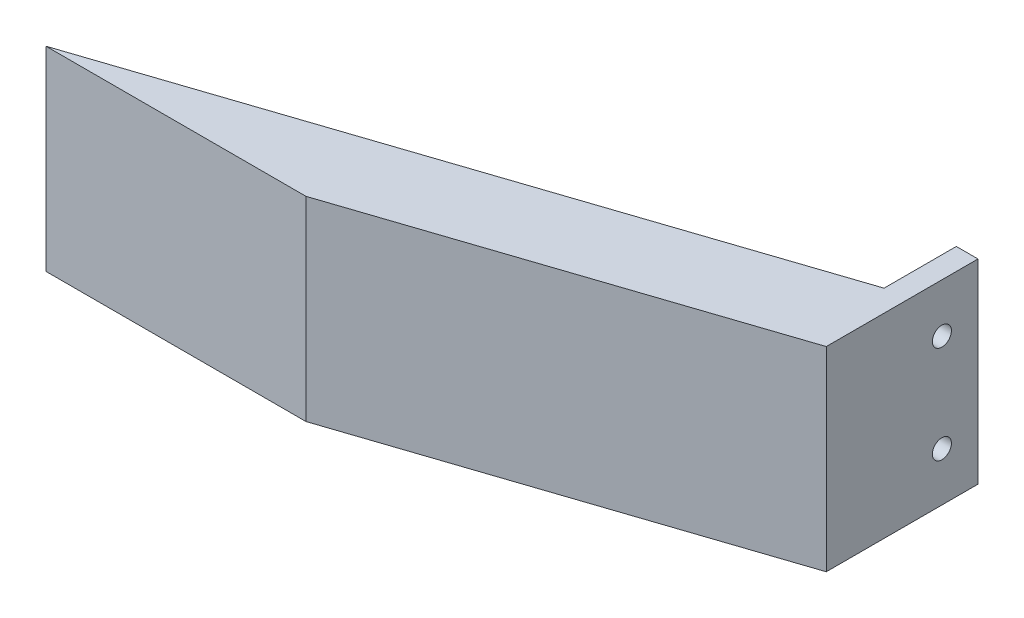
ISO-10303-21;
HEADER;
FILE_DESCRIPTION(('STEP AP214'),'2;1');
FILE_NAME('part.step','',(''),(''),'','','');
FILE_SCHEMA(('AUTOMOTIVE_DESIGN { 1 0 10303 214 1 1 1 1 }'));
ENDSEC;
DATA;
#1=APPLICATION_CONTEXT('core data for automotive mechanical design processes');
#2=APPLICATION_PROTOCOL_DEFINITION('international standard','automotive_design',2000,#1);
#3=PRODUCT_CONTEXT('',#1,'mechanical');
#4=PRODUCT('Part','Part','',(#3));
#5=PRODUCT_RELATED_PRODUCT_CATEGORY('part','',(#4));
#6=PRODUCT_DEFINITION_FORMATION('','',#4);
#7=PRODUCT_DEFINITION_CONTEXT('part definition',#1,'design');
#8=PRODUCT_DEFINITION('design','',#6,#7);
#9=PRODUCT_DEFINITION_SHAPE('','',#8);
#10=(LENGTH_UNIT() NAMED_UNIT(*) SI_UNIT(.MILLI.,.METRE.));
#11=(NAMED_UNIT(*) PLANE_ANGLE_UNIT() SI_UNIT($,.RADIAN.));
#12=(NAMED_UNIT(*) SI_UNIT($,.STERADIAN.) SOLID_ANGLE_UNIT());
#13=UNCERTAINTY_MEASURE_WITH_UNIT(LENGTH_MEASURE(1.E-05),#10,'distance_accuracy_value','');
#14=(GEOMETRIC_REPRESENTATION_CONTEXT(3) GLOBAL_UNCERTAINTY_ASSIGNED_CONTEXT((#13)) GLOBAL_UNIT_ASSIGNED_CONTEXT((#10,
#11,#12)) REPRESENTATION_CONTEXT('',''));
#15=CARTESIAN_POINT('',(0.,0.,0.));
#16=DIRECTION('',(0.,0.,1.));
#17=DIRECTION('',(1.,0.,0.));
#18=AXIS2_PLACEMENT_3D('',#15,#16,#17);
#19=CARTESIAN_POINT('',(0.,45.,0.));
#20=DIRECTION('',(-0.316227766016838,0.,-0.948683298050514));
#21=DIRECTION('',(-0.948683298050514,0.,0.316227766016838));
#22=AXIS2_PLACEMENT_3D('',#19,#20,#21);
#23=PLANE('',#22);
#24=DIRECTION('',(0.948683298050514,0.,-0.316227766016838));
#25=VECTOR('',#24,1.);
#26=CARTESIAN_POINT('',(0.,45.,0.));
#27=LINE('',#26,#25);
#28=CARTESIAN_POINT('',(0.,45.,0.));
#29=VERTEX_POINT('',#28);
#30=CARTESIAN_POINT('',(145.,45.,-48.3333333333333));
#31=VERTEX_POINT('',#30);
#32=EDGE_CURVE('E61',#29,#31,#27,.T.);
#33=ORIENTED_EDGE('',*,*,#32,.T.);
#34=DIRECTION('',(0.,-1.,0.));
#35=VECTOR('',#34,1.);
#36=CARTESIAN_POINT('',(145.,45.,-48.3333333333333));
#37=LINE('',#36,#35);
#38=CARTESIAN_POINT('',(145.,0.,-48.3333333333333));
#39=VERTEX_POINT('',#38);
#40=EDGE_CURVE('E65',#31,#39,#37,.T.);
#41=ORIENTED_EDGE('',*,*,#40,.T.);
#42=DIRECTION('',(0.948683298050514,0.,-0.316227766016838));
#43=VECTOR('',#42,1.);
#44=CARTESIAN_POINT('',(0.,0.,0.));
#45=LINE('',#44,#43);
#46=CARTESIAN_POINT('',(0.,0.,0.));
#47=VERTEX_POINT('',#46);
#48=EDGE_CURVE('E104',#47,#39,#45,.T.);
#49=ORIENTED_EDGE('',*,*,#48,.F.);
#50=DIRECTION('',(0.,-1.,0.));
#51=VECTOR('',#50,1.);
#52=CARTESIAN_POINT('',(0.,45.,0.));
#53=LINE('',#52,#51);
#54=EDGE_CURVE('E54',#29,#47,#53,.T.);
#55=ORIENTED_EDGE('',*,*,#54,.F.);
#56=EDGE_LOOP('',(#33,#41,#49,#55));
#57=FACE_BOUND('',#56,.T.);
#58=ADVANCED_FACE('F45',(#57),#23,.T.);
#59=CARTESIAN_POINT('',(5.99430039478565,45.,17.9880799986134));
#60=DIRECTION('',(0.31614582397381,0.,0.948710608132913));
#61=DIRECTION('',(0.948710608132913,0.,-0.31614582397381));
#62=AXIS2_PLACEMENT_3D('',#59,#60,#61);
#63=PLANE('',#62);
#64=DIRECTION('',(-0.948710608132913,0.,0.31614582397381));
#65=VECTOR('',#64,1.);
#66=CARTESIAN_POINT('',(5.99430039478565,0.,17.9880799986134));
#67=LINE('',#66,#65);
#68=CARTESIAN_POINT('',(150.,0.,-30.));
#69=VERTEX_POINT('',#68);
#70=CARTESIAN_POINT('',(59.9740813076652,0.,0.));
#71=VERTEX_POINT('',#70);
#72=EDGE_CURVE('E136',#69,#71,#67,.T.);
#73=ORIENTED_EDGE('',*,*,#72,.F.);
#74=DIRECTION('',(0.,-1.,0.));
#75=VECTOR('',#74,1.);
#76=CARTESIAN_POINT('',(150.,45.,-30.));
#77=LINE('',#76,#75);
#78=CARTESIAN_POINT('',(150.,45.,-30.));
#79=VERTEX_POINT('',#78);
#80=EDGE_CURVE('E11',#79,#69,#77,.T.);
#81=ORIENTED_EDGE('',*,*,#80,.F.);
#82=DIRECTION('',(-0.948710608132913,0.,0.31614582397381));
#83=VECTOR('',#82,1.);
#84=CARTESIAN_POINT('',(5.99430039478565,45.,17.9880799986134));
#85=LINE('',#84,#83);
#86=CARTESIAN_POINT('',(59.9740813076652,45.,0.));
#87=VERTEX_POINT('',#86);
#88=EDGE_CURVE('E137',#79,#87,#85,.T.);
#89=ORIENTED_EDGE('',*,*,#88,.T.);
#90=DIRECTION('',(0.,-1.,0.));
#91=VECTOR('',#90,1.);
#92=CARTESIAN_POINT('',(59.9740813076652,45.,0.));
#93=LINE('',#92,#91);
#94=EDGE_CURVE('E150',#87,#71,#93,.T.);
#95=ORIENTED_EDGE('',*,*,#94,.T.);
#96=EDGE_LOOP('',(#73,#81,#89,#95));
#97=FACE_BOUND('',#96,.T.);
#98=ADVANCED_FACE('F47',(#97),#63,.T.);
#99=CARTESIAN_POINT('',(150.,45.,0.));
#100=DIRECTION('',(-1.,0.,0.));
#101=DIRECTION('',(0.,0.,1.));
#102=AXIS2_PLACEMENT_3D('',#99,#100,#101);
#103=PLANE('',#102);
#104=CARTESIAN_POINT('',(150.,11.25,-56.6666666666667));
#105=DIRECTION('',(-1.,0.,0.));
#106=DIRECTION('',(0.,0.,1.));
#107=AXIS2_PLACEMENT_3D('',#104,#105,#106);
#108=CIRCLE('',#107,2.2);
#109=CARTESIAN_POINT('',(150.,11.25,-54.4666666666667));
#110=VERTEX_POINT('',#109);
#111=EDGE_CURVE('E131',#110,#110,#108,.T.);
#112=ORIENTED_EDGE('',*,*,#111,.T.);
#113=EDGE_LOOP('',(#112));
#114=FACE_BOUND('',#113,.T.);
#115=CARTESIAN_POINT('',(150.,33.75,-56.6666666666667));
#116=DIRECTION('',(-1.,0.,0.));
#117=DIRECTION('',(0.,0.,1.));
#118=AXIS2_PLACEMENT_3D('',#115,#116,#117);
#119=CIRCLE('',#118,2.2);
#120=CARTESIAN_POINT('',(150.,33.75,-54.4666666666667));
#121=VERTEX_POINT('',#120);
#122=EDGE_CURVE('E190',#121,#121,#119,.T.);
#123=ORIENTED_EDGE('',*,*,#122,.T.);
#124=EDGE_LOOP('',(#123));
#125=FACE_BOUND('',#124,.T.);
#126=DIRECTION('',(0.,0.,-1.));
#127=VECTOR('',#126,1.);
#128=CARTESIAN_POINT('',(150.,0.,0.));
#129=LINE('',#128,#127);
#130=CARTESIAN_POINT('',(150.,0.,-65.));
#131=VERTEX_POINT('',#130);
#132=EDGE_CURVE('E154',#69,#131,#129,.T.);
#133=ORIENTED_EDGE('',*,*,#132,.T.);
#134=DIRECTION('',(0.,1.,0.));
#135=VECTOR('',#134,1.);
#136=CARTESIAN_POINT('',(150.,45.,-65.));
#137=LINE('',#136,#135);
#138=CARTESIAN_POINT('',(150.,45.,-65.));
#139=VERTEX_POINT('',#138);
#140=EDGE_CURVE('E109',#131,#139,#137,.T.);
#141=ORIENTED_EDGE('',*,*,#140,.T.);
#142=DIRECTION('',(0.,0.,-1.));
#143=VECTOR('',#142,1.);
#144=CARTESIAN_POINT('',(150.,45.,0.));
#145=LINE('',#144,#143);
#146=EDGE_CURVE('E141',#79,#139,#145,.T.);
#147=ORIENTED_EDGE('',*,*,#146,.F.);
#148=ORIENTED_EDGE('',*,*,#80,.T.);
#149=EDGE_LOOP('',(#133,#141,#147,#148));
#150=FACE_BOUND('',#149,.T.);
#151=ADVANCED_FACE('F174',(#114,#125,#150),#103,.F.);
#152=CARTESIAN_POINT('',(0.,45.,0.));
#153=DIRECTION('',(0.,0.,-1.));
#154=DIRECTION('',(-1.,0.,0.));
#155=AXIS2_PLACEMENT_3D('',#152,#153,#154);
#156=PLANE('',#155);
#157=DIRECTION('',(1.,0.,0.));
#158=VECTOR('',#157,1.);
#159=CARTESIAN_POINT('',(0.,0.,0.));
#160=LINE('',#159,#158);
#161=EDGE_CURVE('E142',#47,#71,#160,.T.);
#162=ORIENTED_EDGE('',*,*,#161,.T.);
#163=ORIENTED_EDGE('',*,*,#94,.F.);
#164=DIRECTION('',(1.,0.,0.));
#165=VECTOR('',#164,1.);
#166=CARTESIAN_POINT('',(0.,45.,0.));
#167=LINE('',#166,#165);
#168=EDGE_CURVE('E147',#29,#87,#167,.T.);
#169=ORIENTED_EDGE('',*,*,#168,.F.);
#170=ORIENTED_EDGE('',*,*,#54,.T.);
#171=EDGE_LOOP('',(#162,#163,#169,#170));
#172=FACE_BOUND('',#171,.T.);
#173=ADVANCED_FACE('F166',(#172),#156,.F.);
#174=CARTESIAN_POINT('',(0.,45.,0.));
#175=DIRECTION('',(0.,1.,0.));
#176=DIRECTION('',(0.,0.,1.));
#177=AXIS2_PLACEMENT_3D('',#174,#175,#176);
#178=PLANE('',#177);
#179=ORIENTED_EDGE('',*,*,#88,.F.);
#180=ORIENTED_EDGE('',*,*,#146,.T.);
#181=DIRECTION('',(1.,0.,0.));
#182=VECTOR('',#181,1.);
#183=CARTESIAN_POINT('',(145.,45.,-65.));
#184=LINE('',#183,#182);
#185=CARTESIAN_POINT('',(145.,45.,-65.));
#186=VERTEX_POINT('',#185);
#187=EDGE_CURVE('E118',#186,#139,#184,.T.);
#188=ORIENTED_EDGE('',*,*,#187,.F.);
#189=DIRECTION('',(0.,0.,1.));
#190=VECTOR('',#189,1.);
#191=CARTESIAN_POINT('',(145.,45.,-30.));
#192=LINE('',#191,#190);
#193=EDGE_CURVE('E119',#186,#31,#192,.T.);
#194=ORIENTED_EDGE('',*,*,#193,.T.);
#195=ORIENTED_EDGE('',*,*,#32,.F.);
#196=ORIENTED_EDGE('',*,*,#168,.T.);
#197=EDGE_LOOP('',(#179,#180,#188,#194,#195,#196));
#198=FACE_BOUND('',#197,.T.);
#199=ADVANCED_FACE('F183',(#198),#178,.T.);
#200=CARTESIAN_POINT('',(0.,0.,0.));
#201=DIRECTION('',(0.,1.,0.));
#202=DIRECTION('',(0.,0.,1.));
#203=AXIS2_PLACEMENT_3D('',#200,#201,#202);
#204=PLANE('',#203);
#205=ORIENTED_EDGE('',*,*,#132,.F.);
#206=ORIENTED_EDGE('',*,*,#72,.T.);
#207=ORIENTED_EDGE('',*,*,#161,.F.);
#208=ORIENTED_EDGE('',*,*,#48,.T.);
#209=DIRECTION('',(0.,0.,-1.));
#210=VECTOR('',#209,1.);
#211=CARTESIAN_POINT('',(145.,0.,-30.));
#212=LINE('',#211,#210);
#213=CARTESIAN_POINT('',(145.,0.,-65.));
#214=VERTEX_POINT('',#213);
#215=EDGE_CURVE('E97',#39,#214,#212,.T.);
#216=ORIENTED_EDGE('',*,*,#215,.T.);
#217=DIRECTION('',(1.,0.,0.));
#218=VECTOR('',#217,1.);
#219=CARTESIAN_POINT('',(145.,0.,-65.));
#220=LINE('',#219,#218);
#221=EDGE_CURVE('E101',#214,#131,#220,.T.);
#222=ORIENTED_EDGE('',*,*,#221,.T.);
#223=EDGE_LOOP('',(#205,#206,#207,#208,#216,#222));
#224=FACE_BOUND('',#223,.T.);
#225=ADVANCED_FACE('F100',(#224),#204,.F.);
#226=CARTESIAN_POINT('',(145.,45.,-65.));
#227=DIRECTION('',(0.,0.,-1.));
#228=DIRECTION('',(-1.,0.,0.));
#229=AXIS2_PLACEMENT_3D('',#226,#227,#228);
#230=PLANE('',#229);
#231=ORIENTED_EDGE('',*,*,#140,.F.);
#232=ORIENTED_EDGE('',*,*,#221,.F.);
#233=DIRECTION('',(0.,1.,0.));
#234=VECTOR('',#233,1.);
#235=CARTESIAN_POINT('',(145.,45.,-65.));
#236=LINE('',#235,#234);
#237=EDGE_CURVE('E108',#214,#186,#236,.T.);
#238=ORIENTED_EDGE('',*,*,#237,.T.);
#239=ORIENTED_EDGE('',*,*,#187,.T.);
#240=EDGE_LOOP('',(#231,#232,#238,#239));
#241=FACE_BOUND('',#240,.T.);
#242=ADVANCED_FACE('F113',(#241),#230,.T.);
#243=CARTESIAN_POINT('',(145.,0.,0.));
#244=DIRECTION('',(1.,0.,0.));
#245=DIRECTION('',(0.,0.,-1.));
#246=AXIS2_PLACEMENT_3D('',#243,#244,#245);
#247=PLANE('',#246);
#248=CARTESIAN_POINT('',(145.,11.25,-56.6666666666667));
#249=DIRECTION('',(-1.,0.,0.));
#250=DIRECTION('',(0.,0.,1.));
#251=AXIS2_PLACEMENT_3D('',#248,#249,#250);
#252=CIRCLE('',#251,2.2);
#253=CARTESIAN_POINT('',(145.,11.25,-54.4666666666667));
#254=VERTEX_POINT('',#253);
#255=EDGE_CURVE('E217',#254,#254,#252,.T.);
#256=ORIENTED_EDGE('',*,*,#255,.F.);
#257=EDGE_LOOP('',(#256));
#258=FACE_BOUND('',#257,.T.);
#259=CARTESIAN_POINT('',(145.,33.75,-56.6666666666667));
#260=DIRECTION('',(-1.,0.,0.));
#261=DIRECTION('',(0.,0.,1.));
#262=AXIS2_PLACEMENT_3D('',#259,#260,#261);
#263=CIRCLE('',#262,2.2);
#264=CARTESIAN_POINT('',(145.,33.75,-54.4666666666667));
#265=VERTEX_POINT('',#264);
#266=EDGE_CURVE('E219',#265,#265,#263,.T.);
#267=ORIENTED_EDGE('',*,*,#266,.F.);
#268=EDGE_LOOP('',(#267));
#269=FACE_BOUND('',#268,.T.);
#270=ORIENTED_EDGE('',*,*,#40,.F.);
#271=ORIENTED_EDGE('',*,*,#193,.F.);
#272=ORIENTED_EDGE('',*,*,#237,.F.);
#273=ORIENTED_EDGE('',*,*,#215,.F.);
#274=EDGE_LOOP('',(#270,#271,#272,#273));
#275=FACE_BOUND('',#274,.T.);
#276=ADVANCED_FACE('F121',(#258,#269,#275),#247,.F.);
#277=CARTESIAN_POINT('',(150.,33.75,-56.6666666666667));
#278=DIRECTION('',(-1.,0.,0.));
#279=DIRECTION('',(0.,0.,1.));
#280=AXIS2_PLACEMENT_3D('',#277,#278,#279);
#281=CYLINDRICAL_SURFACE('',#280,2.2);
#282=ORIENTED_EDGE('',*,*,#122,.F.);
#283=EDGE_LOOP('',(#282));
#284=FACE_BOUND('',#283,.T.);
#285=ORIENTED_EDGE('',*,*,#266,.T.);
#286=EDGE_LOOP('',(#285));
#287=FACE_BOUND('',#286,.T.);
#288=ADVANCED_FACE('F204',(#284,#287),#281,.F.);
#289=CARTESIAN_POINT('',(150.,11.25,-56.6666666666667));
#290=DIRECTION('',(-1.,0.,0.));
#291=DIRECTION('',(0.,0.,1.));
#292=AXIS2_PLACEMENT_3D('',#289,#290,#291);
#293=CYLINDRICAL_SURFACE('',#292,2.2);
#294=ORIENTED_EDGE('',*,*,#111,.F.);
#295=EDGE_LOOP('',(#294));
#296=FACE_BOUND('',#295,.T.);
#297=ORIENTED_EDGE('',*,*,#255,.T.);
#298=EDGE_LOOP('',(#297));
#299=FACE_BOUND('',#298,.T.);
#300=ADVANCED_FACE('F208',(#296,#299),#293,.F.);
#301=CLOSED_SHELL('',(#58,#98,#151,#173,#199,#225,#242,#276,#288,#300));
#302=MANIFOLD_SOLID_BREP('B2',#301);
#303=ADVANCED_BREP_SHAPE_REPRESENTATION('',(#18,#302),#14);
#304=SHAPE_DEFINITION_REPRESENTATION(#9,#303);
ENDSEC;
END-ISO-10303-21;
